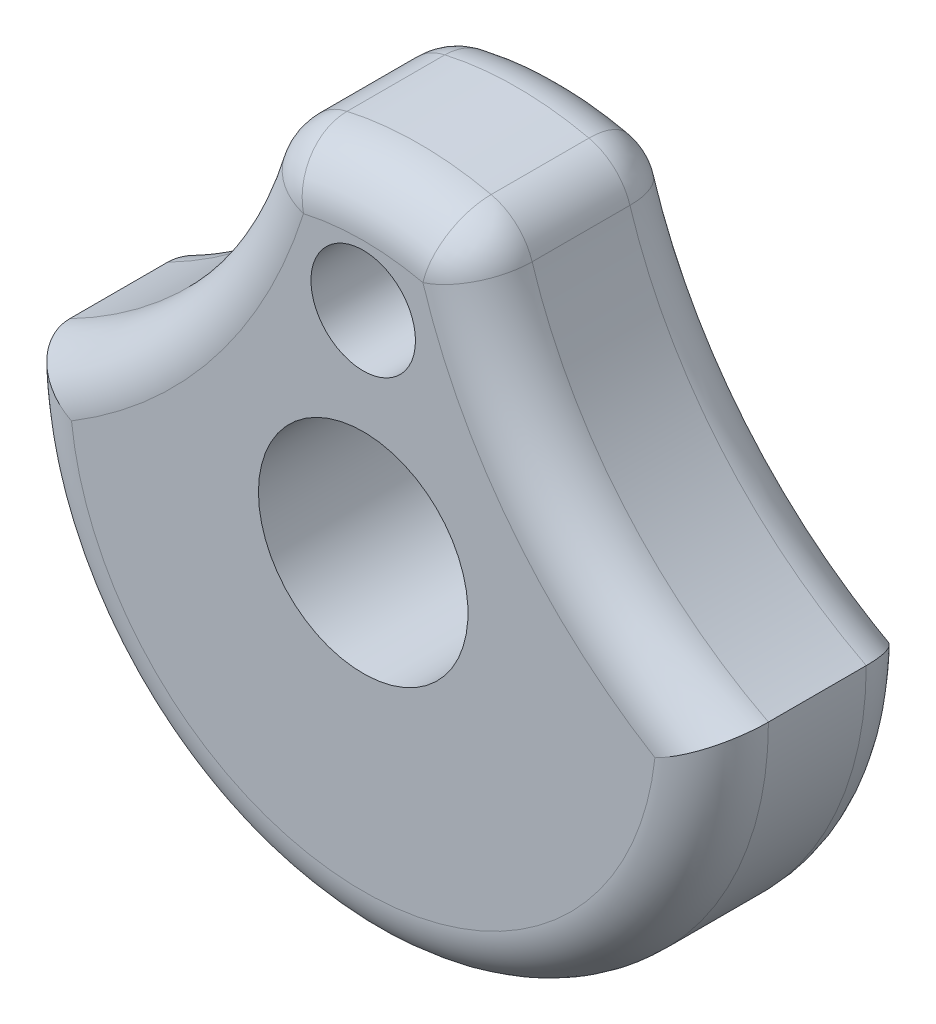
ISO-10303-21;
HEADER;
FILE_DESCRIPTION(('STEP AP214'),'2;1');
FILE_NAME('part.step','',(''),(''),'','','');
FILE_SCHEMA(('AUTOMOTIVE_DESIGN { 1 0 10303 214 1 1 1 1 }'));
ENDSEC;
DATA;
#1=APPLICATION_CONTEXT('core data for automotive mechanical design processes');
#2=APPLICATION_PROTOCOL_DEFINITION('international standard','automotive_design',2000,#1);
#3=PRODUCT_CONTEXT('',#1,'mechanical');
#4=PRODUCT('Part','Part','',(#3));
#5=PRODUCT_RELATED_PRODUCT_CATEGORY('part','',(#4));
#6=PRODUCT_DEFINITION_FORMATION('','',#4);
#7=PRODUCT_DEFINITION_CONTEXT('part definition',#1,'design');
#8=PRODUCT_DEFINITION('design','',#6,#7);
#9=PRODUCT_DEFINITION_SHAPE('','',#8);
#10=(LENGTH_UNIT() NAMED_UNIT(*) SI_UNIT(.MILLI.,.METRE.));
#11=(NAMED_UNIT(*) PLANE_ANGLE_UNIT() SI_UNIT($,.RADIAN.));
#12=(NAMED_UNIT(*) SI_UNIT($,.STERADIAN.) SOLID_ANGLE_UNIT());
#13=UNCERTAINTY_MEASURE_WITH_UNIT(LENGTH_MEASURE(1.E-05),#10,'distance_accuracy_value','');
#14=(GEOMETRIC_REPRESENTATION_CONTEXT(3) GLOBAL_UNCERTAINTY_ASSIGNED_CONTEXT((#13)) GLOBAL_UNIT_ASSIGNED_CONTEXT((#10,
#11,#12)) REPRESENTATION_CONTEXT('',''));
#15=CARTESIAN_POINT('',(0.,0.,0.));
#16=DIRECTION('',(0.,0.,1.));
#17=DIRECTION('',(1.,0.,0.));
#18=AXIS2_PLACEMENT_3D('',#15,#16,#17);
#19=CARTESIAN_POINT('',(-10.1391620519203,7.56557088500805,3.75));
#20=DIRECTION('',(0.,0.,-1.));
#21=DIRECTION('',(-1.,0.,0.));
#22=AXIS2_PLACEMENT_3D('',#19,#20,#21);
#23=CYLINDRICAL_SURFACE('',#22,8.50732488296731);
#24=CARTESIAN_POINT('',(-10.1391620519203,7.56557088500805,2.75));
#25=DIRECTION('',(0.,0.,1.));
#26=DIRECTION('',(1.,0.,0.));
#27=AXIS2_PLACEMENT_3D('',#24,#25,#26);
#28=CIRCLE('',#27,8.50732488296731);
#29=CARTESIAN_POINT('',(-6.25098020510518,-0.00123944633050434,2.75));
#30=VERTEX_POINT('',#29);
#31=CARTESIAN_POINT('',(-2.02258201547725,5.01690355160256,2.75));
#32=VERTEX_POINT('',#31);
#33=EDGE_CURVE('E138',#30,#32,#28,.T.);
#34=ORIENTED_EDGE('',*,*,#33,.T.);
#35=DIRECTION('',(0.,0.,-1.));
#36=VECTOR('',#35,1.);
#37=CARTESIAN_POINT('',(-2.02258201547725,5.01690355160255,3.75));
#38=LINE('',#37,#36);
#39=CARTESIAN_POINT('',(-2.02258201547725,5.01690355160255,1.));
#40=VERTEX_POINT('',#39);
#41=EDGE_CURVE('E381',#32,#40,#38,.T.);
#42=ORIENTED_EDGE('',*,*,#41,.T.);
#43=CARTESIAN_POINT('',(-10.1391620519203,7.56557088500805,1.));
#44=DIRECTION('',(0.,0.,1.));
#45=DIRECTION('',(1.,0.,0.));
#46=AXIS2_PLACEMENT_3D('',#43,#44,#45);
#47=CIRCLE('',#46,8.50732488296731);
#48=CARTESIAN_POINT('',(-6.25098020510518,-0.00123944633050434,1.));
#49=VERTEX_POINT('',#48);
#50=EDGE_CURVE('E141',#40,#49,#47,.F.);
#51=ORIENTED_EDGE('',*,*,#50,.T.);
#52=DIRECTION('',(0.,0.,-1.));
#53=VECTOR('',#52,1.);
#54=CARTESIAN_POINT('',(-6.25098020510518,-0.00123944633050434,3.75));
#55=LINE('',#54,#53);
#56=EDGE_CURVE('E124',#30,#49,#55,.T.);
#57=ORIENTED_EDGE('',*,*,#56,.F.);
#58=EDGE_LOOP('',(#34,#42,#51,#57));
#59=FACE_BOUND('',#58,.T.);
#60=ADVANCED_FACE('F40',(#59),#23,.F.);
#61=CARTESIAN_POINT('',(0.,0.,3.75));
#62=DIRECTION('',(0.,0.,-1.));
#63=DIRECTION('',(-1.,0.,0.));
#64=AXIS2_PLACEMENT_3D('',#61,#62,#63);
#65=CYLINDRICAL_SURFACE('',#64,6.25098032798409);
#66=ORIENTED_EDGE('',*,*,#56,.T.);
#67=CARTESIAN_POINT('',(0.,0.,1.));
#68=DIRECTION('',(0.,0.,1.));
#69=DIRECTION('',(1.,0.,0.));
#70=AXIS2_PLACEMENT_3D('',#67,#68,#69);
#71=CIRCLE('',#70,6.25098032798409);
#72=CARTESIAN_POINT('',(6.25098020510518,-0.0012394463305044,1.));
#73=VERTEX_POINT('',#72);
#74=EDGE_CURVE('E209',#49,#73,#71,.T.);
#75=ORIENTED_EDGE('',*,*,#74,.T.);
#76=DIRECTION('',(0.,0.,-1.));
#77=VECTOR('',#76,1.);
#78=CARTESIAN_POINT('',(6.25098020510518,-0.0012394463305044,3.75));
#79=LINE('',#78,#77);
#80=CARTESIAN_POINT('',(6.25098020510518,-0.0012394463305044,2.75));
#81=VERTEX_POINT('',#80);
#82=EDGE_CURVE('E126',#81,#73,#79,.T.);
#83=ORIENTED_EDGE('',*,*,#82,.F.);
#84=CARTESIAN_POINT('',(0.,0.,2.75));
#85=DIRECTION('',(0.,0.,1.));
#86=DIRECTION('',(1.,0.,0.));
#87=AXIS2_PLACEMENT_3D('',#84,#85,#86);
#88=CIRCLE('',#87,6.25098032798409);
#89=EDGE_CURVE('E121',#81,#30,#88,.F.);
#90=ORIENTED_EDGE('',*,*,#89,.T.);
#91=EDGE_LOOP('',(#66,#75,#83,#90));
#92=FACE_BOUND('',#91,.T.);
#93=ADVANCED_FACE('F123',(#92),#65,.T.);
#94=CARTESIAN_POINT('',(10.1391620519203,7.56557088500805,3.75));
#95=DIRECTION('',(0.,0.,-1.));
#96=DIRECTION('',(-1.,0.,0.));
#97=AXIS2_PLACEMENT_3D('',#94,#95,#96);
#98=CYLINDRICAL_SURFACE('',#97,8.50732488296731);
#99=CARTESIAN_POINT('',(10.1391620519203,7.56557088500805,1.));
#100=DIRECTION('',(0.,0.,1.));
#101=DIRECTION('',(1.,0.,0.));
#102=AXIS2_PLACEMENT_3D('',#99,#100,#101);
#103=CIRCLE('',#102,8.50732488296731);
#104=CARTESIAN_POINT('',(2.02258201547725,5.01690355160256,1.));
#105=VERTEX_POINT('',#104);
#106=EDGE_CURVE('E292',#73,#105,#103,.F.);
#107=ORIENTED_EDGE('',*,*,#106,.T.);
#108=DIRECTION('',(0.,0.,-1.));
#109=VECTOR('',#108,1.);
#110=CARTESIAN_POINT('',(2.02258201547725,5.01690355160256,3.75));
#111=LINE('',#110,#109);
#112=CARTESIAN_POINT('',(2.02258201547725,5.01690355160256,2.75));
#113=VERTEX_POINT('',#112);
#114=EDGE_CURVE('E391',#105,#113,#111,.F.);
#115=ORIENTED_EDGE('',*,*,#114,.T.);
#116=CARTESIAN_POINT('',(10.1391620519203,7.56557088500805,2.75));
#117=DIRECTION('',(0.,0.,1.));
#118=DIRECTION('',(1.,0.,0.));
#119=AXIS2_PLACEMENT_3D('',#116,#117,#118);
#120=CIRCLE('',#119,8.50732488296731);
#121=EDGE_CURVE('E133',#113,#81,#120,.T.);
#122=ORIENTED_EDGE('',*,*,#121,.T.);
#123=ORIENTED_EDGE('',*,*,#82,.T.);
#124=EDGE_LOOP('',(#107,#115,#122,#123));
#125=FACE_BOUND('',#124,.T.);
#126=ADVANCED_FACE('F260',(#125),#98,.F.);
#127=CARTESIAN_POINT('',(0.,3.75,3.75));
#128=DIRECTION('',(0.,0.,-1.));
#129=DIRECTION('',(-1.,0.,0.));
#130=AXIS2_PLACEMENT_3D('',#127,#128,#129);
#131=CYLINDRICAL_SURFACE('',#130,0.935);
#132=CARTESIAN_POINT('',(0.,3.75,3.75));
#133=DIRECTION('',(0.,0.,1.));
#134=DIRECTION('',(1.,0.,0.));
#135=AXIS2_PLACEMENT_3D('',#132,#133,#134);
#136=CIRCLE('',#135,0.935);
#137=CARTESIAN_POINT('',(0.935,3.75,3.75));
#138=VERTEX_POINT('',#137);
#139=EDGE_CURVE('E278',#138,#138,#136,.T.);
#140=ORIENTED_EDGE('',*,*,#139,.T.);
#141=EDGE_LOOP('',(#140));
#142=FACE_BOUND('',#141,.T.);
#143=CARTESIAN_POINT('',(0.,3.75,0.));
#144=DIRECTION('',(0.,0.,1.));
#145=DIRECTION('',(1.,0.,0.));
#146=AXIS2_PLACEMENT_3D('',#143,#144,#145);
#147=CIRCLE('',#146,0.935);
#148=CARTESIAN_POINT('',(0.935,3.75,0.));
#149=VERTEX_POINT('',#148);
#150=EDGE_CURVE('E281',#149,#149,#147,.T.);
#151=ORIENTED_EDGE('',*,*,#150,.F.);
#152=EDGE_LOOP('',(#151));
#153=FACE_BOUND('',#152,.T.);
#154=ADVANCED_FACE('F263',(#142,#153),#131,.F.);
#155=CARTESIAN_POINT('',(0.,0.,3.75));
#156=DIRECTION('',(0.,0.,-1.));
#157=DIRECTION('',(-1.,0.,0.));
#158=AXIS2_PLACEMENT_3D('',#155,#156,#157);
#159=CYLINDRICAL_SURFACE('',#158,5.83681844288319);
#160=CARTESIAN_POINT('',(0.,0.,1.));
#161=DIRECTION('',(0.,0.,1.));
#162=DIRECTION('',(1.,0.,0.));
#163=AXIS2_PLACEMENT_3D('',#160,#161,#162);
#164=CIRCLE('',#163,5.83681844288319);
#165=CARTESIAN_POINT('',(1.28942466102374,5.69261219289749,1.));
#166=VERTEX_POINT('',#165);
#167=CARTESIAN_POINT('',(-1.28942466102374,5.69261219289749,1.));
#168=VERTEX_POINT('',#167);
#169=EDGE_CURVE('E301',#166,#168,#164,.T.);
#170=ORIENTED_EDGE('',*,*,#169,.T.);
#171=DIRECTION('',(0.,0.,-1.));
#172=VECTOR('',#171,1.);
#173=CARTESIAN_POINT('',(-1.28942466102374,5.69261219289749,3.75));
#174=LINE('',#173,#172);
#175=CARTESIAN_POINT('',(-1.28942466102373,5.69261219289749,2.75));
#176=VERTEX_POINT('',#175);
#177=EDGE_CURVE('E362',#168,#176,#174,.F.);
#178=ORIENTED_EDGE('',*,*,#177,.T.);
#179=CARTESIAN_POINT('',(0.,0.,2.75));
#180=DIRECTION('',(0.,0.,1.));
#181=DIRECTION('',(1.,0.,0.));
#182=AXIS2_PLACEMENT_3D('',#179,#180,#181);
#183=CIRCLE('',#182,5.83681844288319);
#184=CARTESIAN_POINT('',(1.28942466102373,5.69261219289749,2.75));
#185=VERTEX_POINT('',#184);
#186=EDGE_CURVE('E384',#176,#185,#183,.F.);
#187=ORIENTED_EDGE('',*,*,#186,.T.);
#188=DIRECTION('',(0.,0.,-1.));
#189=VECTOR('',#188,1.);
#190=CARTESIAN_POINT('',(1.28942466102374,5.69261219289749,3.75));
#191=LINE('',#190,#189);
#192=EDGE_CURVE('E365',#185,#166,#191,.T.);
#193=ORIENTED_EDGE('',*,*,#192,.T.);
#194=EDGE_LOOP('',(#170,#178,#187,#193));
#195=FACE_BOUND('',#194,.T.);
#196=ADVANCED_FACE('F265',(#195),#159,.T.);
#197=CARTESIAN_POINT('',(0.,0.,3.75));
#198=DIRECTION('',(0.,0.,1.));
#199=DIRECTION('',(1.,0.,0.));
#200=AXIS2_PLACEMENT_3D('',#197,#198,#199);
#201=PLANE('',#200);
#202=CARTESIAN_POINT('',(0.,0.,3.75));
#203=DIRECTION('',(0.,0.,-1.));
#204=DIRECTION('',(-1.,0.,0.));
#205=AXIS2_PLACEMENT_3D('',#202,#203,#204);
#206=CIRCLE('',#205,1.875);
#207=CARTESIAN_POINT('',(-1.875,0.,3.75));
#208=VERTEX_POINT('',#207);
#209=EDGE_CURVE('E326',#208,#208,#206,.T.);
#210=ORIENTED_EDGE('',*,*,#209,.T.);
#211=EDGE_LOOP('',(#210));
#212=FACE_BOUND('',#211,.T.);
#213=CARTESIAN_POINT('',(10.1391620519203,7.56557088500805,3.75));
#214=DIRECTION('',(0.,0.,1.));
#215=DIRECTION('',(1.,0.,0.));
#216=AXIS2_PLACEMENT_3D('',#213,#214,#215);
#217=CIRCLE('',#216,9.50732488296731);
#218=CARTESIAN_POINT('',(5.21993217204459,-0.570177625069375,3.75));
#219=VERTEX_POINT('',#218);
#220=CARTESIAN_POINT('',(1.06851241685484,4.71731850360371,3.75));
#221=VERTEX_POINT('',#220);
#222=EDGE_CURVE('E160',#219,#221,#217,.F.);
#223=ORIENTED_EDGE('',*,*,#222,.T.);
#224=CARTESIAN_POINT('',(0.,0.,3.75));
#225=DIRECTION('',(0.,0.,1.));
#226=DIRECTION('',(1.,0.,0.));
#227=AXIS2_PLACEMENT_3D('',#224,#225,#226);
#228=CIRCLE('',#227,4.83681844288319);
#229=CARTESIAN_POINT('',(-1.06851241685484,4.71731850360371,3.75));
#230=VERTEX_POINT('',#229);
#231=EDGE_CURVE('E11',#221,#230,#228,.T.);
#232=ORIENTED_EDGE('',*,*,#231,.T.);
#233=CARTESIAN_POINT('',(-10.1391620519203,7.56557088500805,3.75));
#234=DIRECTION('',(0.,0.,1.));
#235=DIRECTION('',(1.,0.,0.));
#236=AXIS2_PLACEMENT_3D('',#233,#234,#235);
#237=CIRCLE('',#236,9.50732488296731);
#238=CARTESIAN_POINT('',(-5.21993217204459,-0.570177625069375,3.75));
#239=VERTEX_POINT('',#238);
#240=EDGE_CURVE('E166',#230,#239,#237,.F.);
#241=ORIENTED_EDGE('',*,*,#240,.T.);
#242=CARTESIAN_POINT('',(0.,0.,3.75));
#243=DIRECTION('',(0.,0.,1.));
#244=DIRECTION('',(1.,0.,0.));
#245=AXIS2_PLACEMENT_3D('',#242,#243,#244);
#246=CIRCLE('',#245,5.25098032798409);
#247=EDGE_CURVE('E149',#239,#219,#246,.T.);
#248=ORIENTED_EDGE('',*,*,#247,.T.);
#249=EDGE_LOOP('',(#223,#232,#241,#248));
#250=FACE_BOUND('',#249,.T.);
#251=ORIENTED_EDGE('',*,*,#139,.F.);
#252=EDGE_LOOP('',(#251));
#253=FACE_BOUND('',#252,.T.);
#254=ADVANCED_FACE('F271',(#212,#250,#253),#201,.T.);
#255=CARTESIAN_POINT('',(0.,0.,0.));
#256=DIRECTION('',(0.,0.,1.));
#257=DIRECTION('',(1.,0.,0.));
#258=AXIS2_PLACEMENT_3D('',#255,#256,#257);
#259=PLANE('',#258);
#260=CARTESIAN_POINT('',(0.,0.,0.));
#261=DIRECTION('',(0.,0.,-1.));
#262=DIRECTION('',(-1.,0.,0.));
#263=AXIS2_PLACEMENT_3D('',#260,#261,#262);
#264=CIRCLE('',#263,1.875);
#265=CARTESIAN_POINT('',(-1.875,0.,0.));
#266=VERTEX_POINT('',#265);
#267=EDGE_CURVE('E330',#266,#266,#264,.T.);
#268=ORIENTED_EDGE('',*,*,#267,.F.);
#269=EDGE_LOOP('',(#268));
#270=FACE_BOUND('',#269,.T.);
#271=CARTESIAN_POINT('',(0.,0.,0.));
#272=DIRECTION('',(0.,0.,1.));
#273=DIRECTION('',(1.,0.,0.));
#274=AXIS2_PLACEMENT_3D('',#271,#272,#273);
#275=CIRCLE('',#274,5.25098032798409);
#276=CARTESIAN_POINT('',(5.21993217204459,-0.570177625069375,0.));
#277=VERTEX_POINT('',#276);
#278=CARTESIAN_POINT('',(-5.21993217204459,-0.570177625069375,0.));
#279=VERTEX_POINT('',#278);
#280=EDGE_CURVE('E132',#277,#279,#275,.F.);
#281=ORIENTED_EDGE('',*,*,#280,.T.);
#282=CARTESIAN_POINT('',(-10.1391620519203,7.56557088500805,0.));
#283=DIRECTION('',(0.,0.,1.));
#284=DIRECTION('',(1.,0.,0.));
#285=AXIS2_PLACEMENT_3D('',#282,#283,#284);
#286=CIRCLE('',#285,9.50732488296731);
#287=CARTESIAN_POINT('',(-1.06851241685484,4.71731850360372,0.));
#288=VERTEX_POINT('',#287);
#289=EDGE_CURVE('E342',#279,#288,#286,.T.);
#290=ORIENTED_EDGE('',*,*,#289,.T.);
#291=CARTESIAN_POINT('',(0.,0.,0.));
#292=DIRECTION('',(0.,0.,1.));
#293=DIRECTION('',(1.,0.,0.));
#294=AXIS2_PLACEMENT_3D('',#291,#292,#293);
#295=CIRCLE('',#294,4.83681844288319);
#296=CARTESIAN_POINT('',(1.06851241685484,4.71731850360372,0.));
#297=VERTEX_POINT('',#296);
#298=EDGE_CURVE('E350',#288,#297,#295,.F.);
#299=ORIENTED_EDGE('',*,*,#298,.T.);
#300=CARTESIAN_POINT('',(10.1391620519203,7.56557088500805,0.));
#301=DIRECTION('',(0.,0.,1.));
#302=DIRECTION('',(1.,0.,0.));
#303=AXIS2_PLACEMENT_3D('',#300,#301,#302);
#304=CIRCLE('',#303,9.50732488296731);
#305=EDGE_CURVE('E343',#297,#277,#304,.T.);
#306=ORIENTED_EDGE('',*,*,#305,.T.);
#307=EDGE_LOOP('',(#281,#290,#299,#306));
#308=FACE_BOUND('',#307,.T.);
#309=ORIENTED_EDGE('',*,*,#150,.T.);
#310=EDGE_LOOP('',(#309));
#311=FACE_BOUND('',#310,.T.);
#312=ADVANCED_FACE('F192',(#270,#308,#311),#259,.F.);
#313=CARTESIAN_POINT('',(10.1391620519203,7.56557088500805,2.75));
#314=DIRECTION('',(0.,0.,1.));
#315=DIRECTION('',(1.,0.,0.));
#316=AXIS2_PLACEMENT_3D('',#313,#314,#315);
#317=TOROIDAL_SURFACE('',#316,9.50732488296731,1.);
#318=ORIENTED_EDGE('',*,*,#121,.F.);
#319=CARTESIAN_POINT('',(1.06851241685484,4.71731850360372,2.75));
#320=DIRECTION('',(0.29958504799884,-0.954069598622413,0.));
#321=DIRECTION('',(0.954069598622413,0.29958504799884,0.));
#322=AXIS2_PLACEMENT_3D('',#319,#320,#321);
#323=CIRCLE('',#322,1.);
#324=EDGE_CURVE('E64',#113,#221,#323,.T.);
#325=ORIENTED_EDGE('',*,*,#324,.T.);
#326=ORIENTED_EDGE('',*,*,#222,.F.);
#327=CARTESIAN_POINT('',(6.25098020510518,-0.0012394463305044,2.75));
#328=CARTESIAN_POINT('',(6.25098159382672,-0.00123808020724465,2.77517519435811));
#329=CARTESIAN_POINT('',(6.25002869378123,-0.00182021554745173,2.80033709772335));
#330=CARTESIAN_POINT('',(6.24623775712269,-0.00413282522833673,2.85045660534343));
#331=CARTESIAN_POINT('',(6.24340038684346,-0.00586289366870687,2.87541427865582));
#332=CARTESIAN_POINT('',(6.23213603799979,-0.0127230736782671,2.94947601008333));
#333=CARTESIAN_POINT('',(6.22095623515456,-0.0195236050620347,2.9980418674586));
#334=CARTESIAN_POINT('',(6.19179305568848,-0.0371708592014324,3.09220551702791));
#335=CARTESIAN_POINT('',(6.17381620117636,-0.0480137030183463,3.13780610553925));
#336=CARTESIAN_POINT('',(6.13180813646995,-0.0731741981632795,3.22512169739247));
#337=CARTESIAN_POINT('',(6.10777147937895,-0.087494975229294,3.26683315851026));
#338=CARTESIAN_POINT('',(6.05306280750553,-0.119811636002244,3.34774299892037));
#339=CARTESIAN_POINT('',(6.02210092509741,-0.137965084811628,3.38668116192084));
#340=CARTESIAN_POINT('',(5.95542681036109,-0.176646695245966,3.45886443598547));
#341=CARTESIAN_POINT('',(5.91971352610989,-0.19717538259851,3.49210828263385));
#342=CARTESIAN_POINT('',(5.83928378927035,-0.242863754837345,3.5568083307633));
#343=CARTESIAN_POINT('',(5.79400471834619,-0.268271941667672,3.58738871265429));
#344=CARTESIAN_POINT('',(5.6997013923521,-0.320406507989639,3.64071193350178));
#345=CARTESIAN_POINT('',(5.65067268807221,-0.347134439704749,3.6634452794435));
#346=CARTESIAN_POINT('',(5.54049841392905,-0.406237131152299,3.70458338331206));
#347=CARTESIAN_POINT('',(5.47880973057862,-0.438727438749489,3.721366837854));
#348=CARTESIAN_POINT('',(5.35343647883996,-0.503418042648315,3.74388763725601));
#349=CARTESIAN_POINT('',(5.28975628309553,-0.535618798451441,3.74964766265269));
#350=CARTESIAN_POINT('',(5.22390099455173,-0.568215152250797,3.74999478241257));
#351=CARTESIAN_POINT('',(5.22191666243215,-0.569196678775383,3.7500000070678));
#352=CARTESIAN_POINT('',(5.21993217204459,-0.570177625069375,3.75));
#353=B_SPLINE_CURVE_WITH_KNOTS('',3,(#327,#328,#329,#330,#331,#332,#333,#334,#335,#336,#337,
#338,#339,#340,#341,#342,#343,#344,#345,#346,#347,#348,#349,#350,#351,#352),.UNSPECIFIED.,.F.,
.F.,(4,2,2,2,2,2,2,2,2,2,2,2,4),(0.,0.0754750185601868,0.150923363946506,0.301012107777477,
0.450957197996694,0.601037550985874,0.75928366731485,0.917564876571194,1.09763149321151,
1.27791518963662,1.49214877484566,1.70594110185094,1.71258252991999),.UNSPECIFIED.);
#354=EDGE_CURVE('E152',#81,#219,#353,.T.);
#355=ORIENTED_EDGE('',*,*,#354,.F.);
#356=EDGE_LOOP('',(#318,#325,#326,#355));
#357=FACE_BOUND('',#356,.T.);
#358=ADVANCED_FACE('F187',(#357),#317,.T.);
#359=CARTESIAN_POINT('',(0.,0.,2.75));
#360=DIRECTION('',(0.,0.,1.));
#361=DIRECTION('',(1.,0.,0.));
#362=AXIS2_PLACEMENT_3D('',#359,#360,#361);
#363=TOROIDAL_SURFACE('',#362,5.25098032798409,1.);
#364=ORIENTED_EDGE('',*,*,#354,.T.);
#365=ORIENTED_EDGE('',*,*,#247,.F.);
#366=CARTESIAN_POINT('',(-6.25098020510518,-0.00123944633050434,2.75));
#367=CARTESIAN_POINT('',(-6.25098159382672,-0.00123808020724281,2.77517519435811));
#368=CARTESIAN_POINT('',(-6.25002869378123,-0.0018202155474498,2.80033709772335));
#369=CARTESIAN_POINT('',(-6.24623775712269,-0.00413282522833578,2.85045660534343));
#370=CARTESIAN_POINT('',(-6.24340038684346,-0.005862893668707,2.87541427865582));
#371=CARTESIAN_POINT('',(-6.23213603799979,-0.0127230736782689,2.94947601008333));
#372=CARTESIAN_POINT('',(-6.22095623515456,-0.0195236050620354,2.9980418674586));
#373=CARTESIAN_POINT('',(-6.19179305568848,-0.0371708592014317,3.09220551702791));
#374=CARTESIAN_POINT('',(-6.17381620117636,-0.0480137030183451,3.13780610553925));
#375=CARTESIAN_POINT('',(-6.13180813646995,-0.0731741981632786,3.22512169739247));
#376=CARTESIAN_POINT('',(-6.10777147937895,-0.0874949752292938,3.26683315851026));
#377=CARTESIAN_POINT('',(-6.05306280750553,-0.119811636002244,3.34774299892037));
#378=CARTESIAN_POINT('',(-6.02210092509741,-0.137965084811628,3.38668116192084));
#379=CARTESIAN_POINT('',(-5.95542681036109,-0.176646695245965,3.45886443598547));
#380=CARTESIAN_POINT('',(-5.91971352610989,-0.197175382598509,3.49210828263385));
#381=CARTESIAN_POINT('',(-5.83928378927035,-0.242863754837346,3.5568083307633));
#382=CARTESIAN_POINT('',(-5.79400471834619,-0.268271941667676,3.58738871265429));
#383=CARTESIAN_POINT('',(-5.6997013923521,-0.320406507989636,3.64071193350178));
#384=CARTESIAN_POINT('',(-5.6506726880722,-0.347134439704736,3.6634452794435));
#385=CARTESIAN_POINT('',(-5.54049841392906,-0.406237131152317,3.70458338331206));
#386=CARTESIAN_POINT('',(-5.47880973057866,-0.438727438749558,3.721366837854));
#387=CARTESIAN_POINT('',(-5.35343647883993,-0.503418042648245,3.74388763725601));
#388=CARTESIAN_POINT('',(-5.2897562830954,-0.535618798451181,3.74964766265269));
#389=CARTESIAN_POINT('',(-5.22390099455172,-0.56821515225078,3.74999478241257));
#390=CARTESIAN_POINT('',(-5.22191666243214,-0.569196678775375,3.7500000070678));
#391=CARTESIAN_POINT('',(-5.21993217204459,-0.570177625069375,3.75));
#392=B_SPLINE_CURVE_WITH_KNOTS('',3,(#366,#367,#368,#369,#370,#371,#372,#373,#374,#375,#376,
#377,#378,#379,#380,#381,#382,#383,#384,#385,#386,#387,#388,#389,#390,#391),.UNSPECIFIED.,.F.,
.F.,(4,2,2,2,2,2,2,2,2,2,2,2,4),(0.,0.0754750185601868,0.150923363946506,0.301012107777477,
0.450957197996694,0.601037550985874,0.759283667314849,0.917564876571195,1.09763149321151,
1.27791518963662,1.49214877484566,1.70594110185094,1.71258252991999),.UNSPECIFIED.);
#393=EDGE_CURVE('E147',#30,#239,#392,.T.);
#394=ORIENTED_EDGE('',*,*,#393,.F.);
#395=ORIENTED_EDGE('',*,*,#89,.F.);
#396=EDGE_LOOP('',(#364,#365,#394,#395));
#397=FACE_BOUND('',#396,.T.);
#398=ADVANCED_FACE('F148',(#397),#363,.T.);
#399=CARTESIAN_POINT('',(-10.1391620519203,7.56557088500805,2.75));
#400=DIRECTION('',(0.,0.,1.));
#401=DIRECTION('',(1.,0.,0.));
#402=AXIS2_PLACEMENT_3D('',#399,#400,#401);
#403=TOROIDAL_SURFACE('',#402,9.50732488296731,1.);
#404=ORIENTED_EDGE('',*,*,#240,.F.);
#405=CARTESIAN_POINT('',(-1.06851241685484,4.71731850360372,2.75));
#406=DIRECTION('',(0.29958504799884,0.954069598622413,0.));
#407=DIRECTION('',(-0.954069598622413,0.29958504799884,0.));
#408=AXIS2_PLACEMENT_3D('',#405,#406,#407);
#409=CIRCLE('',#408,1.);
#410=EDGE_CURVE('E50',#230,#32,#409,.F.);
#411=ORIENTED_EDGE('',*,*,#410,.T.);
#412=ORIENTED_EDGE('',*,*,#33,.F.);
#413=ORIENTED_EDGE('',*,*,#393,.T.);
#414=EDGE_LOOP('',(#404,#411,#412,#413));
#415=FACE_BOUND('',#414,.T.);
#416=ADVANCED_FACE('F155',(#415),#403,.T.);
#417=CARTESIAN_POINT('',(10.1391620519203,7.56557088500805,1.));
#418=DIRECTION('',(0.,0.,1.));
#419=DIRECTION('',(1.,0.,0.));
#420=AXIS2_PLACEMENT_3D('',#417,#418,#419);
#421=TOROIDAL_SURFACE('',#420,9.50732488296731,1.);
#422=ORIENTED_EDGE('',*,*,#305,.F.);
#423=CARTESIAN_POINT('',(1.06851241685484,4.71731850360372,1.));
#424=DIRECTION('',(0.29958504799884,-0.954069598622413,0.));
#425=DIRECTION('',(0.954069598622413,0.29958504799884,0.));
#426=AXIS2_PLACEMENT_3D('',#423,#424,#425);
#427=CIRCLE('',#426,1.);
#428=EDGE_CURVE('E299',#297,#105,#427,.T.);
#429=ORIENTED_EDGE('',*,*,#428,.T.);
#430=ORIENTED_EDGE('',*,*,#106,.F.);
#431=CARTESIAN_POINT('',(6.25098020510518,-0.0012394463305044,1.));
#432=CARTESIAN_POINT('',(6.25098159382672,-0.0012380802072429,0.974824805641887));
#433=CARTESIAN_POINT('',(6.25002869378123,-0.00182021554744988,0.949662902276652));
#434=CARTESIAN_POINT('',(6.24623775712269,-0.00413282522833581,0.899543394656571));
#435=CARTESIAN_POINT('',(6.24340038684346,-0.00586289366870698,0.874585721344181));
#436=CARTESIAN_POINT('',(6.23213603799979,-0.0127230736782687,0.80052398991667));
#437=CARTESIAN_POINT('',(6.22095623515456,-0.0195236050620352,0.751958132541402));
#438=CARTESIAN_POINT('',(6.19179305568848,-0.0371708592014319,0.657794482972092));
#439=CARTESIAN_POINT('',(6.17381620117636,-0.048013703018346,0.612193894460755));
#440=CARTESIAN_POINT('',(6.13180813646995,-0.0731741981632798,0.524878302607533));
#441=CARTESIAN_POINT('',(6.10777147937896,-0.0874949752292948,0.483166841489739));
#442=CARTESIAN_POINT('',(6.05306280750553,-0.119811636002243,0.40225700107963));
#443=CARTESIAN_POINT('',(6.02210092509741,-0.137965084811626,0.363318838079155));
#444=CARTESIAN_POINT('',(5.95542681036109,-0.176646695245964,0.291135564014531));
#445=CARTESIAN_POINT('',(5.91971352610989,-0.197175382598511,0.257891717366154));
#446=CARTESIAN_POINT('',(5.83928378927035,-0.242863754837347,0.193191669236696));
#447=CARTESIAN_POINT('',(5.79400471834619,-0.268271941667673,0.16261128734571));
#448=CARTESIAN_POINT('',(5.6997013923521,-0.320406507989639,0.109288066498223));
#449=CARTESIAN_POINT('',(5.65067268807221,-0.347134439704749,0.0865547205565035));
#450=CARTESIAN_POINT('',(5.54049841392905,-0.4062371311523,0.0454166166879374));
#451=CARTESIAN_POINT('',(5.47880973057862,-0.438727438749491,0.0286331621460016));
#452=CARTESIAN_POINT('',(5.35343647883996,-0.503418042648317,0.00611236274398739));
#453=CARTESIAN_POINT('',(5.28975628309553,-0.535618798451443,0.000352337347310952));
#454=CARTESIAN_POINT('',(5.22390099455173,-0.568215152250797,5.21758743454045E-06));
#455=CARTESIAN_POINT('',(5.22191666243215,-0.569196678775383,-7.06779843151888E-09));
#456=CARTESIAN_POINT('',(5.21993217204459,-0.570177625069375,0.));
#457=B_SPLINE_CURVE_WITH_KNOTS('',3,(#431,#432,#433,#434,#435,#436,#437,#438,#439,#440,#441,
#442,#443,#444,#445,#446,#447,#448,#449,#450,#451,#452,#453,#454,#455,#456),.UNSPECIFIED.,.F.,
.F.,(4,2,2,2,2,2,2,2,2,2,2,2,4),(0.,0.075475018560187,0.150923363946506,0.301012107777477,
0.450957197996694,0.601037550985873,0.759283667314849,0.917564876571194,1.09763149321151,
1.27791518963662,1.49214877484566,1.70594110185094,1.71258252991999),.UNSPECIFIED.);
#458=EDGE_CURVE('E153',#277,#73,#457,.F.);
#459=ORIENTED_EDGE('',*,*,#458,.F.);
#460=EDGE_LOOP('',(#422,#429,#430,#459));
#461=FACE_BOUND('',#460,.T.);
#462=ADVANCED_FACE('F220',(#461),#421,.T.);
#463=CARTESIAN_POINT('',(0.,0.,1.));
#464=DIRECTION('',(0.,0.,1.));
#465=DIRECTION('',(1.,0.,0.));
#466=AXIS2_PLACEMENT_3D('',#463,#464,#465);
#467=TOROIDAL_SURFACE('',#466,5.25098032798409,1.);
#468=ORIENTED_EDGE('',*,*,#458,.T.);
#469=ORIENTED_EDGE('',*,*,#74,.F.);
#470=CARTESIAN_POINT('',(-6.25098020510518,-0.00123944633050434,1.));
#471=CARTESIAN_POINT('',(-6.25098159382672,-0.00123808020724292,0.974824805641887));
#472=CARTESIAN_POINT('',(-6.25002869378123,-0.00182021554744995,0.949662902276652));
#473=CARTESIAN_POINT('',(-6.24623775712269,-0.00413282522833593,0.899543394656571));
#474=CARTESIAN_POINT('',(-6.24340038684346,-0.0058628936687071,0.874585721344181));
#475=CARTESIAN_POINT('',(-6.23213603799979,-0.0127230736782688,0.80052398991667));
#476=CARTESIAN_POINT('',(-6.22095623515456,-0.0195236050620352,0.751958132541402));
#477=CARTESIAN_POINT('',(-6.19179305568848,-0.0371708592014318,0.657794482972092));
#478=CARTESIAN_POINT('',(-6.17381620117636,-0.0480137030183458,0.612193894460755));
#479=CARTESIAN_POINT('',(-6.13180813646995,-0.0731741981632796,0.524878302607533));
#480=CARTESIAN_POINT('',(-6.10777147937896,-0.0874949752292946,0.483166841489739));
#481=CARTESIAN_POINT('',(-6.05306280750553,-0.119811636002243,0.40225700107963));
#482=CARTESIAN_POINT('',(-6.02210092509741,-0.137965084811626,0.363318838079155));
#483=CARTESIAN_POINT('',(-5.95542681036109,-0.176646695245965,0.291135564014531));
#484=CARTESIAN_POINT('',(-5.91971352610989,-0.197175382598511,0.257891717366154));
#485=CARTESIAN_POINT('',(-5.83928378927035,-0.242863754837347,0.193191669236696));
#486=CARTESIAN_POINT('',(-5.79400471834619,-0.268271941667671,0.16261128734571));
#487=CARTESIAN_POINT('',(-5.6997013923521,-0.320406507989637,0.109288066498223));
#488=CARTESIAN_POINT('',(-5.65067268807221,-0.347134439704749,0.0865547205565035));
#489=CARTESIAN_POINT('',(-5.54049841392905,-0.406237131152299,0.0454166166879376));
#490=CARTESIAN_POINT('',(-5.47880973057862,-0.438727438749489,0.0286331621460019));
#491=CARTESIAN_POINT('',(-5.35343647883996,-0.503418042648321,0.00611236274398791));
#492=CARTESIAN_POINT('',(-5.28975628309553,-0.535618798451454,0.000352337347311595));
#493=CARTESIAN_POINT('',(-5.22390099455173,-0.568215152250797,5.21758743457837E-06));
#494=CARTESIAN_POINT('',(-5.22191666243215,-0.569196678775383,-7.06779841251926E-09));
#495=CARTESIAN_POINT('',(-5.21993217204459,-0.570177625069375,0.));
#496=B_SPLINE_CURVE_WITH_KNOTS('',3,(#470,#471,#472,#473,#474,#475,#476,#477,#478,#479,#480,
#481,#482,#483,#484,#485,#486,#487,#488,#489,#490,#491,#492,#493,#494,#495),.UNSPECIFIED.,.F.,
.F.,(4,2,2,2,2,2,2,2,2,2,2,2,4),(0.,0.075475018560187,0.150923363946506,0.301012107777477,
0.450957197996694,0.601037550985873,0.75928366731485,0.917564876571194,1.09763149321151,
1.27791518963662,1.49214877484566,1.70594110185094,1.71258252991998),.UNSPECIFIED.);
#497=EDGE_CURVE('E201',#279,#49,#496,.F.);
#498=ORIENTED_EDGE('',*,*,#497,.F.);
#499=ORIENTED_EDGE('',*,*,#280,.F.);
#500=EDGE_LOOP('',(#468,#469,#498,#499));
#501=FACE_BOUND('',#500,.T.);
#502=ADVANCED_FACE('F217',(#501),#467,.T.);
#503=CARTESIAN_POINT('',(0.,0.,1.));
#504=DIRECTION('',(0.,0.,1.));
#505=DIRECTION('',(1.,0.,0.));
#506=AXIS2_PLACEMENT_3D('',#503,#504,#505);
#507=TOROIDAL_SURFACE('',#506,4.83681844288319,1.);
#508=ORIENTED_EDGE('',*,*,#298,.F.);
#509=CARTESIAN_POINT('',(-1.06851241685484,4.71731850360372,1.));
#510=DIRECTION('',(-0.975293689293774,-0.220912244168898,0.));
#511=DIRECTION('',(0.220912244168898,-0.975293689293774,0.));
#512=AXIS2_PLACEMENT_3D('',#509,#510,#511);
#513=CIRCLE('',#512,1.);
#514=EDGE_CURVE('E372',#288,#168,#513,.F.);
#515=ORIENTED_EDGE('',*,*,#514,.T.);
#516=ORIENTED_EDGE('',*,*,#169,.F.);
#517=CARTESIAN_POINT('',(1.06851241685484,4.71731850360372,1.));
#518=DIRECTION('',(-0.975293689293774,0.220912244168898,0.));
#519=DIRECTION('',(-0.220912244168898,-0.975293689293774,0.));
#520=AXIS2_PLACEMENT_3D('',#517,#518,#519);
#521=CIRCLE('',#520,1.);
#522=EDGE_CURVE('E374',#166,#297,#521,.T.);
#523=ORIENTED_EDGE('',*,*,#522,.T.);
#524=EDGE_LOOP('',(#508,#515,#516,#523));
#525=FACE_BOUND('',#524,.T.);
#526=ADVANCED_FACE('F197',(#525),#507,.T.);
#527=CARTESIAN_POINT('',(-10.1391620519203,7.56557088500805,1.));
#528=DIRECTION('',(0.,0.,1.));
#529=DIRECTION('',(1.,0.,0.));
#530=AXIS2_PLACEMENT_3D('',#527,#528,#529);
#531=TOROIDAL_SURFACE('',#530,9.50732488296731,1.);
#532=ORIENTED_EDGE('',*,*,#50,.F.);
#533=CARTESIAN_POINT('',(-1.06851241685484,4.71731850360371,1.));
#534=DIRECTION('',(0.299585047998841,0.954069598622413,0.));
#535=DIRECTION('',(-0.954069598622413,0.299585047998841,0.));
#536=AXIS2_PLACEMENT_3D('',#533,#534,#535);
#537=CIRCLE('',#536,1.);
#538=EDGE_CURVE('E347',#40,#288,#537,.F.);
#539=ORIENTED_EDGE('',*,*,#538,.T.);
#540=ORIENTED_EDGE('',*,*,#289,.F.);
#541=ORIENTED_EDGE('',*,*,#497,.T.);
#542=EDGE_LOOP('',(#532,#539,#540,#541));
#543=FACE_BOUND('',#542,.T.);
#544=ADVANCED_FACE('F193',(#543),#531,.T.);
#545=CARTESIAN_POINT('',(1.06851241685484,4.71731850360372,1.));
#546=DIRECTION('',(0.,0.,1.));
#547=DIRECTION('',(1.,0.,0.));
#548=AXIS2_PLACEMENT_3D('',#545,#546,#547);
#549=SPHERICAL_SURFACE('',#548,1.);
#550=ORIENTED_EDGE('',*,*,#428,.F.);
#551=ORIENTED_EDGE('',*,*,#522,.F.);
#552=CARTESIAN_POINT('',(1.06851241685484,4.71731850360372,1.));
#553=DIRECTION('',(0.,0.,1.));
#554=DIRECTION('',(1.,0.,0.));
#555=AXIS2_PLACEMENT_3D('',#552,#553,#554);
#556=CIRCLE('',#555,1.);
#557=EDGE_CURVE('E44',#105,#166,#556,.T.);
#558=ORIENTED_EDGE('',*,*,#557,.F.);
#559=EDGE_LOOP('',(#550,#551,#558));
#560=FACE_BOUND('',#559,.T.);
#561=ADVANCED_FACE('F42',(#560),#549,.T.);
#562=CARTESIAN_POINT('',(1.06851241685484,4.71731850360372,3.75));
#563=DIRECTION('',(0.,0.,1.));
#564=DIRECTION('',(1.,0.,0.));
#565=AXIS2_PLACEMENT_3D('',#562,#563,#564);
#566=CYLINDRICAL_SURFACE('',#565,1.);
#567=CARTESIAN_POINT('',(1.06851241685484,4.71731850360372,2.75));
#568=DIRECTION('',(0.,0.,1.));
#569=DIRECTION('',(1.,0.,0.));
#570=AXIS2_PLACEMENT_3D('',#567,#568,#569);
#571=CIRCLE('',#570,1.);
#572=EDGE_CURVE('E308',#113,#185,#571,.T.);
#573=ORIENTED_EDGE('',*,*,#572,.F.);
#574=ORIENTED_EDGE('',*,*,#114,.F.);
#575=ORIENTED_EDGE('',*,*,#557,.T.);
#576=ORIENTED_EDGE('',*,*,#192,.F.);
#577=EDGE_LOOP('',(#573,#574,#575,#576));
#578=FACE_BOUND('',#577,.T.);
#579=ADVANCED_FACE('F246',(#578),#566,.T.);
#580=CARTESIAN_POINT('',(1.06851241685484,4.71731850360372,2.75));
#581=DIRECTION('',(0.220912244168897,0.975293689293774,0.));
#582=DIRECTION('',(-0.975293689293774,0.220912244168897,0.));
#583=AXIS2_PLACEMENT_3D('',#580,#581,#582);
#584=SPHERICAL_SURFACE('',#583,1.);
#585=ORIENTED_EDGE('',*,*,#324,.F.);
#586=ORIENTED_EDGE('',*,*,#572,.T.);
#587=CARTESIAN_POINT('',(1.06851241685484,4.71731850360372,2.75));
#588=DIRECTION('',(-0.975293689293774,0.220912244168898,0.));
#589=DIRECTION('',(-0.220912244168898,-0.975293689293774,0.));
#590=AXIS2_PLACEMENT_3D('',#587,#588,#589);
#591=CIRCLE('',#590,1.);
#592=EDGE_CURVE('E311',#221,#185,#591,.T.);
#593=ORIENTED_EDGE('',*,*,#592,.F.);
#594=EDGE_LOOP('',(#585,#586,#593));
#595=FACE_BOUND('',#594,.T.);
#596=ADVANCED_FACE('F243',(#595),#584,.T.);
#597=CARTESIAN_POINT('',(0.,0.,2.75));
#598=DIRECTION('',(0.,0.,1.));
#599=DIRECTION('',(1.,0.,0.));
#600=AXIS2_PLACEMENT_3D('',#597,#598,#599);
#601=TOROIDAL_SURFACE('',#600,4.83681844288319,1.);
#602=CARTESIAN_POINT('',(-1.06851241685484,4.71731850360372,2.75));
#603=DIRECTION('',(-0.975293689293774,-0.220912244168897,0.));
#604=DIRECTION('',(0.220912244168897,-0.975293689293775,0.));
#605=AXIS2_PLACEMENT_3D('',#602,#603,#604);
#606=CIRCLE('',#605,1.);
#607=EDGE_CURVE('E314',#230,#176,#606,.T.);
#608=ORIENTED_EDGE('',*,*,#607,.F.);
#609=ORIENTED_EDGE('',*,*,#231,.F.);
#610=ORIENTED_EDGE('',*,*,#592,.T.);
#611=ORIENTED_EDGE('',*,*,#186,.F.);
#612=EDGE_LOOP('',(#608,#609,#610,#611));
#613=FACE_BOUND('',#612,.T.);
#614=ADVANCED_FACE('F239',(#613),#601,.T.);
#615=CARTESIAN_POINT('',(-1.06851241685484,4.71731850360372,2.75));
#616=DIRECTION('',(-0.220912244168897,0.975293689293774,0.));
#617=DIRECTION('',(-0.975293689293774,-0.220912244168897,0.));
#618=AXIS2_PLACEMENT_3D('',#615,#616,#617);
#619=SPHERICAL_SURFACE('',#618,1.);
#620=ORIENTED_EDGE('',*,*,#410,.F.);
#621=ORIENTED_EDGE('',*,*,#607,.T.);
#622=CARTESIAN_POINT('',(-1.06851241685484,4.71731850360372,2.75));
#623=DIRECTION('',(0.,0.,-1.));
#624=DIRECTION('',(-1.,0.,0.));
#625=AXIS2_PLACEMENT_3D('',#622,#623,#624);
#626=CIRCLE('',#625,1.);
#627=EDGE_CURVE('E318',#32,#176,#626,.T.);
#628=ORIENTED_EDGE('',*,*,#627,.F.);
#629=EDGE_LOOP('',(#620,#621,#628));
#630=FACE_BOUND('',#629,.T.);
#631=ADVANCED_FACE('F235',(#630),#619,.T.);
#632=CARTESIAN_POINT('',(-1.06851241685484,4.71731850360371,3.75));
#633=DIRECTION('',(0.,0.,1.));
#634=DIRECTION('',(1.,0.,0.));
#635=AXIS2_PLACEMENT_3D('',#632,#633,#634);
#636=CYLINDRICAL_SURFACE('',#635,1.);
#637=ORIENTED_EDGE('',*,*,#627,.T.);
#638=ORIENTED_EDGE('',*,*,#177,.F.);
#639=CARTESIAN_POINT('',(-1.06851241685484,4.71731850360371,1.));
#640=DIRECTION('',(0.,0.,-1.));
#641=DIRECTION('',(-1.,0.,0.));
#642=AXIS2_PLACEMENT_3D('',#639,#640,#641);
#643=CIRCLE('',#642,1.);
#644=EDGE_CURVE('E322',#40,#168,#643,.T.);
#645=ORIENTED_EDGE('',*,*,#644,.F.);
#646=ORIENTED_EDGE('',*,*,#41,.F.);
#647=EDGE_LOOP('',(#637,#638,#645,#646));
#648=FACE_BOUND('',#647,.T.);
#649=ADVANCED_FACE('F231',(#648),#636,.T.);
#650=CARTESIAN_POINT('',(-1.06851241685484,4.71731850360371,1.));
#651=DIRECTION('',(0.,0.,1.));
#652=DIRECTION('',(1.,0.,0.));
#653=AXIS2_PLACEMENT_3D('',#650,#651,#652);
#654=SPHERICAL_SURFACE('',#653,1.);
#655=ORIENTED_EDGE('',*,*,#644,.T.);
#656=ORIENTED_EDGE('',*,*,#514,.F.);
#657=ORIENTED_EDGE('',*,*,#538,.F.);
#658=EDGE_LOOP('',(#655,#656,#657));
#659=FACE_BOUND('',#658,.T.);
#660=ADVANCED_FACE('F227',(#659),#654,.T.);
#661=CARTESIAN_POINT('',(0.,0.,3.75));
#662=DIRECTION('',(0.,0.,-1.));
#663=DIRECTION('',(-1.,0.,0.));
#664=AXIS2_PLACEMENT_3D('',#661,#662,#663);
#665=CYLINDRICAL_SURFACE('',#664,1.875);
#666=ORIENTED_EDGE('',*,*,#209,.F.);
#667=EDGE_LOOP('',(#666));
#668=FACE_BOUND('',#667,.T.);
#669=ORIENTED_EDGE('',*,*,#267,.T.);
#670=EDGE_LOOP('',(#669));
#671=FACE_BOUND('',#670,.T.);
#672=ADVANCED_FACE('F230',(#668,#671),#665,.F.);
#673=CLOSED_SHELL('',(#60,#93,#126,#154,#196,#254,#312,#358,#398,#416,#462,#502,#526,#544,#561,
#579,#596,#614,#631,#649,#660,#672));
#674=MANIFOLD_SOLID_BREP('B2',#673);
#675=ADVANCED_BREP_SHAPE_REPRESENTATION('',(#18,#674),#14);
#676=SHAPE_DEFINITION_REPRESENTATION(#9,#675);
ENDSEC;
END-ISO-10303-21;
